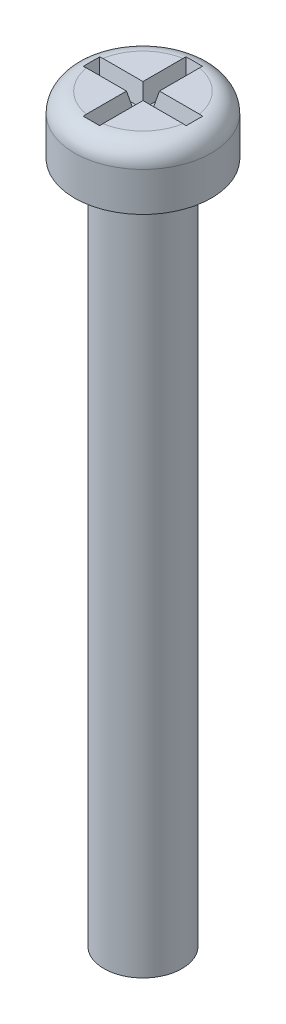
ISO-10303-21;
HEADER;
FILE_DESCRIPTION(('STEP AP214'),'2;1');
FILE_NAME('part.step','',(''),(''),'','','');
FILE_SCHEMA(('AUTOMOTIVE_DESIGN { 1 0 10303 214 1 1 1 1 }'));
ENDSEC;
DATA;
#1=APPLICATION_CONTEXT('core data for automotive mechanical design processes');
#2=APPLICATION_PROTOCOL_DEFINITION('international standard','automotive_design',2000,#1);
#3=PRODUCT_CONTEXT('',#1,'mechanical');
#4=PRODUCT('Part','Part','',(#3));
#5=PRODUCT_RELATED_PRODUCT_CATEGORY('part','',(#4));
#6=PRODUCT_DEFINITION_FORMATION('','',#4);
#7=PRODUCT_DEFINITION_CONTEXT('part definition',#1,'design');
#8=PRODUCT_DEFINITION('design','',#6,#7);
#9=PRODUCT_DEFINITION_SHAPE('','',#8);
#10=(LENGTH_UNIT() NAMED_UNIT(*) SI_UNIT(.MILLI.,.METRE.));
#11=(NAMED_UNIT(*) PLANE_ANGLE_UNIT() SI_UNIT($,.RADIAN.));
#12=(NAMED_UNIT(*) SI_UNIT($,.STERADIAN.) SOLID_ANGLE_UNIT());
#13=UNCERTAINTY_MEASURE_WITH_UNIT(LENGTH_MEASURE(1.E-05),#10,'distance_accuracy_value','');
#14=(GEOMETRIC_REPRESENTATION_CONTEXT(3) GLOBAL_UNCERTAINTY_ASSIGNED_CONTEXT((#13)) GLOBAL_UNIT_ASSIGNED_CONTEXT((#10,
#11,#12)) REPRESENTATION_CONTEXT('',''));
#15=CARTESIAN_POINT('',(0.,0.,0.));
#16=DIRECTION('',(0.,0.,1.));
#17=DIRECTION('',(1.,0.,0.));
#18=AXIS2_PLACEMENT_3D('',#15,#16,#17);
#19=CARTESIAN_POINT('',(0.,38.,0.));
#20=DIRECTION('',(0.,1.,0.));
#21=DIRECTION('',(0.,0.,1.));
#22=AXIS2_PLACEMENT_3D('',#19,#20,#21);
#23=PLANE('',#22);
#24=DIRECTION('',(-1.,0.,0.));
#25=VECTOR('',#24,1.);
#26=CARTESIAN_POINT('',(0.422769915905619,38.,-0.422769915905619));
#27=LINE('',#26,#25);
#28=CARTESIAN_POINT('',(2.47921168886506,38.,-0.422769915905619));
#29=VERTEX_POINT('',#28);
#30=CARTESIAN_POINT('',(0.422769915905619,38.,-0.422769915905619));
#31=VERTEX_POINT('',#30);
#32=EDGE_CURVE('E377',#29,#31,#27,.T.);
#33=ORIENTED_EDGE('',*,*,#32,.F.);
#34=CARTESIAN_POINT('',(0.,38.,0.));
#35=DIRECTION('',(0.,1.,0.));
#36=DIRECTION('',(0.,0.,1.));
#37=AXIS2_PLACEMENT_3D('',#34,#35,#36);
#38=CIRCLE('',#37,2.515);
#39=CARTESIAN_POINT('',(0.422769915905619,38.,-2.47921168886506));
#40=VERTEX_POINT('',#39);
#41=EDGE_CURVE('E263',#29,#40,#38,.T.);
#42=ORIENTED_EDGE('',*,*,#41,.T.);
#43=DIRECTION('',(0.,0.,-1.));
#44=VECTOR('',#43,1.);
#45=CARTESIAN_POINT('',(0.422769915905619,38.,-2.64154947271322));
#46=LINE('',#45,#44);
#47=EDGE_CURVE('E162',#31,#40,#46,.T.);
#48=ORIENTED_EDGE('',*,*,#47,.F.);
#49=EDGE_LOOP('',(#33,#42,#48));
#50=FACE_BOUND('',#49,.T.);
#51=ADVANCED_FACE('F35',(#50),#23,.T.);
#52=DIRECTION('',(0.,0.,1.));
#53=VECTOR('',#52,1.);
#54=CARTESIAN_POINT('',(-0.422769915905619,38.,-0.422769915905619));
#55=LINE('',#54,#53);
#56=CARTESIAN_POINT('',(-0.422769915905619,38.,-2.47921168886506));
#57=VERTEX_POINT('',#56);
#58=CARTESIAN_POINT('',(-0.422769915905619,38.,-0.422769915905619));
#59=VERTEX_POINT('',#58);
#60=EDGE_CURVE('E149',#57,#59,#55,.T.);
#61=ORIENTED_EDGE('',*,*,#60,.F.);
#62=CARTESIAN_POINT('',(0.,38.,0.));
#63=DIRECTION('',(0.,1.,0.));
#64=DIRECTION('',(0.,0.,1.));
#65=AXIS2_PLACEMENT_3D('',#62,#63,#64);
#66=CIRCLE('',#65,2.515);
#67=CARTESIAN_POINT('',(-2.47921168886506,38.,-0.422769915905619));
#68=VERTEX_POINT('',#67);
#69=EDGE_CURVE('E175',#57,#68,#66,.T.);
#70=ORIENTED_EDGE('',*,*,#69,.T.);
#71=DIRECTION('',(-1.,0.,0.));
#72=VECTOR('',#71,1.);
#73=CARTESIAN_POINT('',(-2.64154947271322,38.,-0.422769915905619));
#74=LINE('',#73,#72);
#75=EDGE_CURVE('E161',#59,#68,#74,.T.);
#76=ORIENTED_EDGE('',*,*,#75,.F.);
#77=EDGE_LOOP('',(#61,#70,#76));
#78=FACE_BOUND('',#77,.T.);
#79=ADVANCED_FACE('F174',(#78),#23,.T.);
#80=DIRECTION('',(1.,0.,0.));
#81=VECTOR('',#80,1.);
#82=CARTESIAN_POINT('',(-0.422769915905619,38.,0.422769915905619));
#83=LINE('',#82,#81);
#84=CARTESIAN_POINT('',(-2.47921168886506,38.,0.422769915905619));
#85=VERTEX_POINT('',#84);
#86=CARTESIAN_POINT('',(-0.422769915905619,38.,0.422769915905619));
#87=VERTEX_POINT('',#86);
#88=EDGE_CURVE('E176',#85,#87,#83,.T.);
#89=ORIENTED_EDGE('',*,*,#88,.F.);
#90=CARTESIAN_POINT('',(0.,38.,0.));
#91=DIRECTION('',(0.,1.,0.));
#92=DIRECTION('',(0.,0.,1.));
#93=AXIS2_PLACEMENT_3D('',#90,#91,#92);
#94=CIRCLE('',#93,2.515);
#95=CARTESIAN_POINT('',(-0.422769915905619,38.,2.47921168886506));
#96=VERTEX_POINT('',#95);
#97=EDGE_CURVE('E260',#85,#96,#94,.T.);
#98=ORIENTED_EDGE('',*,*,#97,.T.);
#99=DIRECTION('',(0.,0.,1.));
#100=VECTOR('',#99,1.);
#101=CARTESIAN_POINT('',(-0.422769915905619,38.,2.64154947271322));
#102=LINE('',#101,#100);
#103=EDGE_CURVE('E178',#87,#96,#102,.T.);
#104=ORIENTED_EDGE('',*,*,#103,.F.);
#105=EDGE_LOOP('',(#89,#98,#104));
#106=FACE_BOUND('',#105,.T.);
#107=ADVANCED_FACE('F407',(#106),#23,.T.);
#108=CARTESIAN_POINT('',(0.,35.,0.));
#109=DIRECTION('',(0.,-1.,0.));
#110=DIRECTION('',(0.,0.,-1.));
#111=AXIS2_PLACEMENT_3D('',#108,#109,#110);
#112=CYLINDRICAL_SURFACE('',#111,2.);
#113=CARTESIAN_POINT('',(0.,35.,0.));
#114=DIRECTION('',(0.,1.,0.));
#115=DIRECTION('',(0.,0.,1.));
#116=AXIS2_PLACEMENT_3D('',#113,#114,#115);
#117=CIRCLE('',#116,2.);
#118=CARTESIAN_POINT('',(0.,35.,2.));
#119=VERTEX_POINT('',#118);
#120=EDGE_CURVE('E253',#119,#119,#117,.T.);
#121=ORIENTED_EDGE('',*,*,#120,.F.);
#122=EDGE_LOOP('',(#121));
#123=FACE_BOUND('',#122,.T.);
#124=CARTESIAN_POINT('',(0.,0.,0.));
#125=DIRECTION('',(0.,1.,0.));
#126=DIRECTION('',(0.,0.,1.));
#127=AXIS2_PLACEMENT_3D('',#124,#125,#126);
#128=CIRCLE('',#127,2.);
#129=CARTESIAN_POINT('',(0.,0.,2.));
#130=VERTEX_POINT('',#129);
#131=EDGE_CURVE('E252',#130,#130,#128,.T.);
#132=ORIENTED_EDGE('',*,*,#131,.T.);
#133=EDGE_LOOP('',(#132));
#134=FACE_BOUND('',#133,.T.);
#135=ADVANCED_FACE('F412',(#123,#134),#112,.T.);
#136=CARTESIAN_POINT('',(0.,0.,0.));
#137=DIRECTION('',(0.,1.,0.));
#138=DIRECTION('',(0.,0.,1.));
#139=AXIS2_PLACEMENT_3D('',#136,#137,#138);
#140=PLANE('',#139);
#141=ORIENTED_EDGE('',*,*,#131,.F.);
#142=EDGE_LOOP('',(#141));
#143=FACE_BOUND('',#142,.T.);
#144=ADVANCED_FACE('F417',(#143),#140,.F.);
#145=CARTESIAN_POINT('',(0.,38.,0.));
#146=DIRECTION('',(0.,-1.,0.));
#147=DIRECTION('',(0.,0.,-1.));
#148=AXIS2_PLACEMENT_3D('',#145,#146,#147);
#149=CYLINDRICAL_SURFACE('',#148,3.515);
#150=CARTESIAN_POINT('',(0.,37.,0.));
#151=DIRECTION('',(0.,1.,0.));
#152=DIRECTION('',(0.,0.,1.));
#153=AXIS2_PLACEMENT_3D('',#150,#151,#152);
#154=CIRCLE('',#153,3.515);
#155=CARTESIAN_POINT('',(0.,37.,3.515));
#156=VERTEX_POINT('',#155);
#157=EDGE_CURVE('E11',#156,#156,#154,.F.);
#158=ORIENTED_EDGE('',*,*,#157,.T.);
#159=EDGE_LOOP('',(#158));
#160=FACE_BOUND('',#159,.T.);
#161=CARTESIAN_POINT('',(0.,35.,0.));
#162=DIRECTION('',(0.,1.,0.));
#163=DIRECTION('',(0.,0.,1.));
#164=AXIS2_PLACEMENT_3D('',#161,#162,#163);
#165=CIRCLE('',#164,3.515);
#166=CARTESIAN_POINT('',(0.,35.,3.515));
#167=VERTEX_POINT('',#166);
#168=EDGE_CURVE('E191',#167,#167,#165,.T.);
#169=ORIENTED_EDGE('',*,*,#168,.T.);
#170=EDGE_LOOP('',(#169));
#171=FACE_BOUND('',#170,.T.);
#172=ADVANCED_FACE('F421',(#160,#171),#149,.T.);
#173=DIRECTION('',(0.,0.,-1.));
#174=VECTOR('',#173,1.);
#175=CARTESIAN_POINT('',(0.422769915905619,38.,0.422769915905619));
#176=LINE('',#175,#174);
#177=CARTESIAN_POINT('',(0.422769915905619,38.,2.47921168886506));
#178=VERTEX_POINT('',#177);
#179=CARTESIAN_POINT('',(0.422769915905619,38.,0.422769915905619));
#180=VERTEX_POINT('',#179);
#181=EDGE_CURVE('E184',#178,#180,#176,.T.);
#182=ORIENTED_EDGE('',*,*,#181,.F.);
#183=CARTESIAN_POINT('',(0.,38.,0.));
#184=DIRECTION('',(0.,1.,0.));
#185=DIRECTION('',(0.,0.,1.));
#186=AXIS2_PLACEMENT_3D('',#183,#184,#185);
#187=CIRCLE('',#186,2.515);
#188=CARTESIAN_POINT('',(2.47921168886506,38.,0.422769915905619));
#189=VERTEX_POINT('',#188);
#190=EDGE_CURVE('E256',#178,#189,#187,.T.);
#191=ORIENTED_EDGE('',*,*,#190,.T.);
#192=DIRECTION('',(1.,0.,0.));
#193=VECTOR('',#192,1.);
#194=CARTESIAN_POINT('',(2.64154947271322,38.,0.422769915905619));
#195=LINE('',#194,#193);
#196=EDGE_CURVE('E186',#180,#189,#195,.T.);
#197=ORIENTED_EDGE('',*,*,#196,.F.);
#198=EDGE_LOOP('',(#182,#191,#197));
#199=FACE_BOUND('',#198,.T.);
#200=ADVANCED_FACE('F366',(#199),#23,.T.);
#201=CARTESIAN_POINT('',(0.,35.,0.));
#202=DIRECTION('',(0.,1.,0.));
#203=DIRECTION('',(0.,0.,1.));
#204=AXIS2_PLACEMENT_3D('',#201,#202,#203);
#205=PLANE('',#204);
#206=ORIENTED_EDGE('',*,*,#120,.T.);
#207=EDGE_LOOP('',(#206));
#208=FACE_BOUND('',#207,.T.);
#209=ORIENTED_EDGE('',*,*,#168,.F.);
#210=EDGE_LOOP('',(#209));
#211=FACE_BOUND('',#210,.T.);
#212=ADVANCED_FACE('F420',(#208,#211),#205,.F.);
#213=CARTESIAN_POINT('',(0.422769915905619,38.,-0.422769915905619));
#214=DIRECTION('',(0.,-0.207911690817759,-0.978147600733806));
#215=DIRECTION('',(0.,0.978147600733806,-0.207911690817759));
#216=AXIS2_PLACEMENT_3D('',#213,#214,#215);
#217=PLANE('',#216);
#218=DIRECTION('',(0.203558594952779,0.957667894857973,-0.203558594952779));
#219=VECTOR('',#218,1.);
#220=CARTESIAN_POINT('',(2.60651359835308,37.8351691705734,-0.387734041545471));
#221=LINE('',#220,#219);
#222=CARTESIAN_POINT('',(2.4289929110432,37.,-0.210213354235596));
#223=VERTEX_POINT('',#222);
#224=CARTESIAN_POINT('',(2.63890864587035,37.9875758865211,-0.420129089062744));
#225=VERTEX_POINT('',#224);
#226=EDGE_CURVE('E189',#223,#225,#221,.T.);
#227=ORIENTED_EDGE('',*,*,#226,.T.);
#228=CARTESIAN_POINT('',(2.63890864587035,37.9875758865211,-0.420129089062744));
#229=CARTESIAN_POINT('',(2.61246025382318,37.9917103029364,-0.421007886400498));
#230=CARTESIAN_POINT('',(2.58592795776817,37.9948128539393,-0.421667353974071));
#231=CARTESIAN_POINT('',(2.53269563825816,37.9989542188483,-0.422547628259755));
#232=CARTESIAN_POINT('',(2.50599561531141,37.9999930390051,-0.422768436300485));
#233=CARTESIAN_POINT('',(2.47921168886509,38.0000000000002,-0.422769915905651));
#234=B_SPLINE_CURVE_WITH_KNOTS('',3,(#228,#229,#230,#231,#232,#233),.UNSPECIFIED.,.F.,.F.,(4,2,
4),(0.,0.0801636519091327,0.160327061016982),.UNSPECIFIED.);
#235=EDGE_CURVE('E44',#225,#29,#234,.T.);
#236=ORIENTED_EDGE('',*,*,#235,.T.);
#237=ORIENTED_EDGE('',*,*,#32,.T.);
#238=DIRECTION('',(0.203558594952779,0.957667894857973,-0.203558594952779));
#239=VECTOR('',#238,1.);
#240=CARTESIAN_POINT('',(0.514707491003239,38.4325322839967,-0.514707491003239));
#241=LINE('',#240,#239);
#242=CARTESIAN_POINT('',(0.210213354235596,37.,-0.210213354235596));
#243=VERTEX_POINT('',#242);
#244=EDGE_CURVE('E193',#243,#31,#241,.T.);
#245=ORIENTED_EDGE('',*,*,#244,.F.);
#246=DIRECTION('',(-1.,0.,0.));
#247=VECTOR('',#246,1.);
#248=CARTESIAN_POINT('',(0.,37.,-0.210213354235596));
#249=LINE('',#248,#247);
#250=EDGE_CURVE('E188',#223,#243,#249,.T.);
#251=ORIENTED_EDGE('',*,*,#250,.F.);
#252=EDGE_LOOP('',(#227,#236,#237,#245,#251));
#253=FACE_BOUND('',#252,.T.);
#254=ADVANCED_FACE('F285',(#253),#217,.F.);
#255=CARTESIAN_POINT('',(2.64154947271322,38.,0.422769915905619));
#256=DIRECTION('',(0.978147600733806,-0.207911690817759,0.));
#257=DIRECTION('',(0.207911690817759,0.978147600733806,0.));
#258=AXIS2_PLACEMENT_3D('',#255,#256,#257);
#259=PLANE('',#258);
#260=DIRECTION('',(0.203558594952779,0.957667894857973,0.203558594952779));
#261=VECTOR('',#260,1.);
#262=CARTESIAN_POINT('',(2.64154947271322,38.,0.422769915905619));
#263=LINE('',#262,#261);
#264=CARTESIAN_POINT('',(2.4289929110432,37.,0.210213354235596));
#265=VERTEX_POINT('',#264);
#266=CARTESIAN_POINT('',(2.63890864587035,37.9875758865211,0.420129089062743));
#267=VERTEX_POINT('',#266);
#268=EDGE_CURVE('E192',#265,#267,#263,.T.);
#269=ORIENTED_EDGE('',*,*,#268,.T.);
#270=CARTESIAN_POINT('',(2.63890864587035,37.9875758865211,0.420129089062743));
#271=CARTESIAN_POINT('',(2.63926052612753,37.989231352974,0.350115794791615));
#272=CARTESIAN_POINT('',(2.63950472425311,37.9903802148282,0.280093037473652));
#273=CARTESIAN_POINT('',(2.63981715218977,37.9918500727061,0.140046852645141));
#274=CARTESIAN_POINT('',(2.6398854040906,37.9921711726538,0.0700234263225704));
#275=CARTESIAN_POINT('',(2.6398854040906,37.9921711726538,-0.070023426322571));
#276=CARTESIAN_POINT('',(2.63981715218977,37.9918500727061,-0.140046852645142));
#277=CARTESIAN_POINT('',(2.63950472425311,37.9903802148282,-0.280093037473653));
#278=CARTESIAN_POINT('',(2.63926052612753,37.989231352974,-0.350115794791616));
#279=CARTESIAN_POINT('',(2.63890864587035,37.9875758865211,-0.420129089062744));
#280=B_SPLINE_CURVE_WITH_KNOTS('',3,(#270,#271,#272,#273,#274,#275,#276,#277,#278,#279),
.UNSPECIFIED.,.F.,.F.,(4,2,2,2,4),(0.,0.210094701314381,0.420163024312075,0.630231347309768,
0.840326048624149),.UNSPECIFIED.);
#281=EDGE_CURVE('E51',#267,#225,#280,.T.);
#282=ORIENTED_EDGE('',*,*,#281,.T.);
#283=ORIENTED_EDGE('',*,*,#226,.F.);
#284=DIRECTION('',(0.,0.,-1.));
#285=VECTOR('',#284,1.);
#286=CARTESIAN_POINT('',(2.4289929110432,37.,0.));
#287=LINE('',#286,#285);
#288=EDGE_CURVE('E197',#265,#223,#287,.T.);
#289=ORIENTED_EDGE('',*,*,#288,.F.);
#290=EDGE_LOOP('',(#269,#282,#283,#289));
#291=FACE_BOUND('',#290,.T.);
#292=ADVANCED_FACE('F362',(#291),#259,.F.);
#293=CARTESIAN_POINT('',(2.64154947271322,38.,0.422769915905619));
#294=DIRECTION('',(0.,-0.207911690817759,0.978147600733806));
#295=DIRECTION('',(0.,-0.978147600733806,-0.207911690817759));
#296=AXIS2_PLACEMENT_3D('',#293,#294,#295);
#297=PLANE('',#296);
#298=ORIENTED_EDGE('',*,*,#196,.T.);
#299=CARTESIAN_POINT('',(2.47921168886506,38.,0.422769915905619));
#300=CARTESIAN_POINT('',(2.5059956153114,37.9999930390051,0.422768436300468));
#301=CARTESIAN_POINT('',(2.53269563825815,37.9989542188483,0.422547628259749));
#302=CARTESIAN_POINT('',(2.58592795776817,37.9948128539393,0.421667353974077));
#303=CARTESIAN_POINT('',(2.61246025382318,37.9917103029365,0.421007886400505));
#304=CARTESIAN_POINT('',(2.63890864587035,37.9875758865211,0.420129089062746));
#305=B_SPLINE_CURVE_WITH_KNOTS('',3,(#299,#300,#301,#302,#303,#304),.UNSPECIFIED.,.F.,.F.,(4,2,
4),(0.,0.0801634091078605,0.160327061016998),.UNSPECIFIED.);
#306=EDGE_CURVE('E59',#189,#267,#305,.T.);
#307=ORIENTED_EDGE('',*,*,#306,.T.);
#308=ORIENTED_EDGE('',*,*,#268,.F.);
#309=DIRECTION('',(1.,0.,0.));
#310=VECTOR('',#309,1.);
#311=CARTESIAN_POINT('',(0.,37.,0.210213354235596));
#312=LINE('',#311,#310);
#313=CARTESIAN_POINT('',(0.210213354235596,37.,0.210213354235596));
#314=VERTEX_POINT('',#313);
#315=EDGE_CURVE('E224',#314,#265,#312,.T.);
#316=ORIENTED_EDGE('',*,*,#315,.F.);
#317=DIRECTION('',(0.203558594952779,0.957667894857973,0.203558594952779));
#318=VECTOR('',#317,1.);
#319=CARTESIAN_POINT('',(0.514707491003239,38.4325322839967,0.514707491003239));
#320=LINE('',#319,#318);
#321=EDGE_CURVE('E215',#314,#180,#320,.T.);
#322=ORIENTED_EDGE('',*,*,#321,.T.);
#323=EDGE_LOOP('',(#298,#307,#308,#316,#322));
#324=FACE_BOUND('',#323,.T.);
#325=ADVANCED_FACE('F357',(#324),#297,.F.);
#326=CARTESIAN_POINT('',(0.422769915905619,38.,0.422769915905619));
#327=DIRECTION('',(0.978147600733806,-0.207911690817759,0.));
#328=DIRECTION('',(0.207911690817759,0.978147600733806,0.));
#329=AXIS2_PLACEMENT_3D('',#326,#327,#328);
#330=PLANE('',#329);
#331=DIRECTION('',(0.203558594952779,0.957667894857973,0.203558594952779));
#332=VECTOR('',#331,1.);
#333=CARTESIAN_POINT('',(0.387734041545471,37.8351691705734,2.60651359835307));
#334=LINE('',#333,#332);
#335=CARTESIAN_POINT('',(0.210213354235596,37.,2.4289929110432));
#336=VERTEX_POINT('',#335);
#337=CARTESIAN_POINT('',(0.420129089062744,37.9875758865211,2.63890864587035));
#338=VERTEX_POINT('',#337);
#339=EDGE_CURVE('E212',#336,#338,#334,.T.);
#340=ORIENTED_EDGE('',*,*,#339,.T.);
#341=CARTESIAN_POINT('',(0.420129089062744,37.9875758865211,2.63890864587035));
#342=CARTESIAN_POINT('',(0.421007886400498,37.9917103029364,2.61246025382318));
#343=CARTESIAN_POINT('',(0.421667353974071,37.9948128539393,2.58592795776817));
#344=CARTESIAN_POINT('',(0.422547628259755,37.9989542188483,2.53269563825816));
#345=CARTESIAN_POINT('',(0.422768436300485,37.9999930390051,2.50599561531141));
#346=CARTESIAN_POINT('',(0.422769915905651,38.0000000000002,2.47921168886509));
#347=B_SPLINE_CURVE_WITH_KNOTS('',3,(#341,#342,#343,#344,#345,#346),.UNSPECIFIED.,.F.,.F.,(4,2,
4),(0.,0.0801636519091322,0.160327061016981),.UNSPECIFIED.);
#348=EDGE_CURVE('E344',#338,#178,#347,.T.);
#349=ORIENTED_EDGE('',*,*,#348,.T.);
#350=ORIENTED_EDGE('',*,*,#181,.T.);
#351=ORIENTED_EDGE('',*,*,#321,.F.);
#352=DIRECTION('',(0.,0.,-1.));
#353=VECTOR('',#352,1.);
#354=CARTESIAN_POINT('',(0.210213354235596,37.,0.));
#355=LINE('',#354,#353);
#356=EDGE_CURVE('E227',#336,#314,#355,.T.);
#357=ORIENTED_EDGE('',*,*,#356,.F.);
#358=EDGE_LOOP('',(#340,#349,#350,#351,#357));
#359=FACE_BOUND('',#358,.T.);
#360=ADVANCED_FACE('F354',(#359),#330,.F.);
#361=CARTESIAN_POINT('',(-0.422769915905619,38.,2.64154947271322));
#362=DIRECTION('',(0.,-0.207911690817759,0.978147600733806));
#363=DIRECTION('',(0.,-0.978147600733806,-0.207911690817759));
#364=AXIS2_PLACEMENT_3D('',#361,#362,#363);
#365=PLANE('',#364);
#366=DIRECTION('',(-0.203558594952779,0.957667894857973,0.203558594952779));
#367=VECTOR('',#366,1.);
#368=CARTESIAN_POINT('',(-0.422769915905619,38.,2.64154947271322));
#369=LINE('',#368,#367);
#370=CARTESIAN_POINT('',(-0.210213354235597,37.,2.4289929110432));
#371=VERTEX_POINT('',#370);
#372=CARTESIAN_POINT('',(-0.420129089062743,37.9875758865211,2.63890864587035));
#373=VERTEX_POINT('',#372);
#374=EDGE_CURVE('E209',#371,#373,#369,.T.);
#375=ORIENTED_EDGE('',*,*,#374,.T.);
#376=CARTESIAN_POINT('',(-0.420129089062743,37.9875758865211,2.63890864587035));
#377=CARTESIAN_POINT('',(-0.350115794791615,37.989231352974,2.63926052612753));
#378=CARTESIAN_POINT('',(-0.280093037473653,37.9903802148282,2.63950472425311));
#379=CARTESIAN_POINT('',(-0.140046852645141,37.9918500727061,2.63981715218977));
#380=CARTESIAN_POINT('',(-0.0700234263225706,37.9921711726538,2.6398854040906));
#381=CARTESIAN_POINT('',(0.0700234263225708,37.9921711726538,2.6398854040906));
#382=CARTESIAN_POINT('',(0.140046852645142,37.9918500727061,2.63981715218977));
#383=CARTESIAN_POINT('',(0.280093037473653,37.9903802148282,2.63950472425311));
#384=CARTESIAN_POINT('',(0.350115794791616,37.989231352974,2.63926052612753));
#385=CARTESIAN_POINT('',(0.420129089062744,37.9875758865211,2.63890864587035));
#386=B_SPLINE_CURVE_WITH_KNOTS('',3,(#376,#377,#378,#379,#380,#381,#382,#383,#384,#385),
.UNSPECIFIED.,.F.,.F.,(4,2,2,2,4),(0.,0.210094701314381,0.420163024312075,0.630231347309768,
0.84032604862415),.UNSPECIFIED.);
#387=EDGE_CURVE('E339',#373,#338,#386,.T.);
#388=ORIENTED_EDGE('',*,*,#387,.T.);
#389=ORIENTED_EDGE('',*,*,#339,.F.);
#390=DIRECTION('',(1.,0.,0.));
#391=VECTOR('',#390,1.);
#392=CARTESIAN_POINT('',(0.,37.,2.4289929110432));
#393=LINE('',#392,#391);
#394=EDGE_CURVE('E230',#371,#336,#393,.T.);
#395=ORIENTED_EDGE('',*,*,#394,.F.);
#396=EDGE_LOOP('',(#375,#388,#389,#395));
#397=FACE_BOUND('',#396,.T.);
#398=ADVANCED_FACE('F330',(#397),#365,.F.);
#399=CARTESIAN_POINT('',(-0.422769915905619,38.,2.64154947271322));
#400=DIRECTION('',(-0.978147600733806,-0.207911690817759,0.));
#401=DIRECTION('',(0.207911690817759,-0.978147600733806,0.));
#402=AXIS2_PLACEMENT_3D('',#399,#400,#401);
#403=PLANE('',#402);
#404=ORIENTED_EDGE('',*,*,#103,.T.);
#405=CARTESIAN_POINT('',(-0.422769915905619,38.,2.47921168886506));
#406=CARTESIAN_POINT('',(-0.422768436300468,37.9999930390051,2.5059956153114));
#407=CARTESIAN_POINT('',(-0.422547628259749,37.9989542188483,2.53269563825815));
#408=CARTESIAN_POINT('',(-0.421667353974077,37.9948128539393,2.58592795776817));
#409=CARTESIAN_POINT('',(-0.421007886400505,37.9917103029365,2.61246025382318));
#410=CARTESIAN_POINT('',(-0.420129089062746,37.9875758865211,2.63890864587035));
#411=B_SPLINE_CURVE_WITH_KNOTS('',3,(#405,#406,#407,#408,#409,#410),.UNSPECIFIED.,.F.,.F.,(4,2,
4),(0.,0.0801634091078605,0.160327061016998),.UNSPECIFIED.);
#412=EDGE_CURVE('E334',#96,#373,#411,.T.);
#413=ORIENTED_EDGE('',*,*,#412,.T.);
#414=ORIENTED_EDGE('',*,*,#374,.F.);
#415=DIRECTION('',(0.,0.,1.));
#416=VECTOR('',#415,1.);
#417=CARTESIAN_POINT('',(-0.210213354235596,37.,0.));
#418=LINE('',#417,#416);
#419=CARTESIAN_POINT('',(-0.210213354235596,37.,0.210213354235596));
#420=VERTEX_POINT('',#419);
#421=EDGE_CURVE('E233',#420,#371,#418,.T.);
#422=ORIENTED_EDGE('',*,*,#421,.F.);
#423=DIRECTION('',(-0.203558594952779,0.957667894857973,0.203558594952779));
#424=VECTOR('',#423,1.);
#425=CARTESIAN_POINT('',(-0.514707491003239,38.4325322839967,0.514707491003239));
#426=LINE('',#425,#424);
#427=EDGE_CURVE('E206',#420,#87,#426,.T.);
#428=ORIENTED_EDGE('',*,*,#427,.T.);
#429=EDGE_LOOP('',(#404,#413,#414,#422,#428));
#430=FACE_BOUND('',#429,.T.);
#431=ADVANCED_FACE('F325',(#430),#403,.F.);
#432=CARTESIAN_POINT('',(-0.422769915905619,38.,0.422769915905619));
#433=DIRECTION('',(0.,-0.207911690817759,0.978147600733806));
#434=DIRECTION('',(0.,-0.978147600733806,-0.207911690817759));
#435=AXIS2_PLACEMENT_3D('',#432,#433,#434);
#436=PLANE('',#435);
#437=DIRECTION('',(-0.203558594952779,0.957667894857973,0.203558594952779));
#438=VECTOR('',#437,1.);
#439=CARTESIAN_POINT('',(-2.64154947271322,38.,0.422769915905619));
#440=LINE('',#439,#438);
#441=CARTESIAN_POINT('',(-2.4289929110432,37.,0.210213354235596));
#442=VERTEX_POINT('',#441);
#443=CARTESIAN_POINT('',(-2.63890864587035,37.9875758865211,0.420129089062743));
#444=VERTEX_POINT('',#443);
#445=EDGE_CURVE('E203',#442,#444,#440,.T.);
#446=ORIENTED_EDGE('',*,*,#445,.T.);
#447=CARTESIAN_POINT('',(-2.63890864587035,37.9875758865211,0.420129089062743));
#448=CARTESIAN_POINT('',(-2.61246025382318,37.9917103029364,0.421007886400498));
#449=CARTESIAN_POINT('',(-2.58592795776817,37.9948128539393,0.421667353974071));
#450=CARTESIAN_POINT('',(-2.53269563825816,37.9989542188483,0.422547628259755));
#451=CARTESIAN_POINT('',(-2.50599561531141,37.9999930390051,0.422768436300485));
#452=CARTESIAN_POINT('',(-2.47921168886509,38.0000000000002,0.422769915905651));
#453=B_SPLINE_CURVE_WITH_KNOTS('',3,(#447,#448,#449,#450,#451,#452),.UNSPECIFIED.,.F.,.F.,(4,2,
4),(0.,0.0801636519091322,0.160327061016981),.UNSPECIFIED.);
#454=EDGE_CURVE('E311',#444,#85,#453,.T.);
#455=ORIENTED_EDGE('',*,*,#454,.T.);
#456=ORIENTED_EDGE('',*,*,#88,.T.);
#457=ORIENTED_EDGE('',*,*,#427,.F.);
#458=DIRECTION('',(1.,0.,0.));
#459=VECTOR('',#458,1.);
#460=CARTESIAN_POINT('',(0.,37.,0.210213354235596));
#461=LINE('',#460,#459);
#462=EDGE_CURVE('E236',#442,#420,#461,.T.);
#463=ORIENTED_EDGE('',*,*,#462,.F.);
#464=EDGE_LOOP('',(#446,#455,#456,#457,#463));
#465=FACE_BOUND('',#464,.T.);
#466=ADVANCED_FACE('F320',(#465),#436,.F.);
#467=CARTESIAN_POINT('',(-2.64154947271322,38.,0.422769915905619));
#468=DIRECTION('',(-0.978147600733806,-0.207911690817759,0.));
#469=DIRECTION('',(0.207911690817759,-0.978147600733806,0.));
#470=AXIS2_PLACEMENT_3D('',#467,#468,#469);
#471=PLANE('',#470);
#472=DIRECTION('',(-0.203558594952779,0.957667894857973,-0.203558594952779));
#473=VECTOR('',#472,1.);
#474=CARTESIAN_POINT('',(-2.64154947271322,38.,-0.422769915905619));
#475=LINE('',#474,#473);
#476=CARTESIAN_POINT('',(-2.4289929110432,37.,-0.210213354235596));
#477=VERTEX_POINT('',#476);
#478=CARTESIAN_POINT('',(-2.63890864587035,37.9875758865211,-0.420129089062743));
#479=VERTEX_POINT('',#478);
#480=EDGE_CURVE('E171',#477,#479,#475,.T.);
#481=ORIENTED_EDGE('',*,*,#480,.T.);
#482=CARTESIAN_POINT('',(-2.63890864587035,37.9875758865211,-0.420129089062743));
#483=CARTESIAN_POINT('',(-2.63926052612753,37.989231352974,-0.350115794791616));
#484=CARTESIAN_POINT('',(-2.63950472425311,37.9903802148282,-0.280093037473653));
#485=CARTESIAN_POINT('',(-2.63981715218977,37.9918500727061,-0.140046852645141));
#486=CARTESIAN_POINT('',(-2.6398854040906,37.9921711726538,-0.0700234263225706));
#487=CARTESIAN_POINT('',(-2.6398854040906,37.9921711726538,0.0700234263225706));
#488=CARTESIAN_POINT('',(-2.63981715218977,37.9918500727061,0.140046852645141));
#489=CARTESIAN_POINT('',(-2.63950472425311,37.9903802148282,0.280093037473653));
#490=CARTESIAN_POINT('',(-2.63926052612753,37.989231352974,0.350115794791615));
#491=CARTESIAN_POINT('',(-2.63890864587035,37.9875758865211,0.420129089062743));
#492=B_SPLINE_CURVE_WITH_KNOTS('',3,(#482,#483,#484,#485,#486,#487,#488,#489,#490,#491),
.UNSPECIFIED.,.F.,.F.,(4,2,2,2,4),(0.,0.210094701314381,0.420163024312074,0.630231347309768,
0.840326048624149),.UNSPECIFIED.);
#493=EDGE_CURVE('E306',#479,#444,#492,.T.);
#494=ORIENTED_EDGE('',*,*,#493,.T.);
#495=ORIENTED_EDGE('',*,*,#445,.F.);
#496=DIRECTION('',(0.,0.,1.));
#497=VECTOR('',#496,1.);
#498=CARTESIAN_POINT('',(-2.4289929110432,37.,0.));
#499=LINE('',#498,#497);
#500=EDGE_CURVE('E239',#477,#442,#499,.T.);
#501=ORIENTED_EDGE('',*,*,#500,.F.);
#502=EDGE_LOOP('',(#481,#494,#495,#501));
#503=FACE_BOUND('',#502,.T.);
#504=ADVANCED_FACE('F317',(#503),#471,.F.);
#505=CARTESIAN_POINT('',(-2.64154947271322,38.,-0.422769915905619));
#506=DIRECTION('',(0.,-0.207911690817759,-0.978147600733806));
#507=DIRECTION('',(0.,0.978147600733806,-0.207911690817759));
#508=AXIS2_PLACEMENT_3D('',#505,#506,#507);
#509=PLANE('',#508);
#510=ORIENTED_EDGE('',*,*,#75,.T.);
#511=CARTESIAN_POINT('',(-2.47921168886506,38.,-0.422769915905619));
#512=CARTESIAN_POINT('',(-2.5059956153114,37.9999930390051,-0.422768436300468));
#513=CARTESIAN_POINT('',(-2.53269563825815,37.9989542188483,-0.422547628259749));
#514=CARTESIAN_POINT('',(-2.58592795776817,37.9948128539393,-0.421667353974077));
#515=CARTESIAN_POINT('',(-2.61246025382318,37.9917103029365,-0.421007886400505));
#516=CARTESIAN_POINT('',(-2.63890864587035,37.9875758865211,-0.420129089062746));
#517=B_SPLINE_CURVE_WITH_KNOTS('',3,(#511,#512,#513,#514,#515,#516),.UNSPECIFIED.,.F.,.F.,(4,2,
4),(0.,0.0801634091078605,0.160327061016998),.UNSPECIFIED.);
#518=EDGE_CURVE('E301',#68,#479,#517,.T.);
#519=ORIENTED_EDGE('',*,*,#518,.T.);
#520=ORIENTED_EDGE('',*,*,#480,.F.);
#521=DIRECTION('',(-1.,0.,0.));
#522=VECTOR('',#521,1.);
#523=CARTESIAN_POINT('',(0.,37.,-0.210213354235596));
#524=LINE('',#523,#522);
#525=CARTESIAN_POINT('',(-0.210213354235596,37.,-0.210213354235596));
#526=VERTEX_POINT('',#525);
#527=EDGE_CURVE('E169',#526,#477,#524,.T.);
#528=ORIENTED_EDGE('',*,*,#527,.F.);
#529=DIRECTION('',(-0.203558594952779,0.957667894857973,-0.203558594952779));
#530=VECTOR('',#529,1.);
#531=CARTESIAN_POINT('',(-0.514707491003239,38.4325322839967,-0.514707491003239));
#532=LINE('',#531,#530);
#533=EDGE_CURVE('E154',#526,#59,#532,.T.);
#534=ORIENTED_EDGE('',*,*,#533,.T.);
#535=EDGE_LOOP('',(#510,#519,#520,#528,#534));
#536=FACE_BOUND('',#535,.T.);
#537=ADVANCED_FACE('F166',(#536),#509,.F.);
#538=CARTESIAN_POINT('',(-0.422769915905619,38.,-0.422769915905619));
#539=DIRECTION('',(-0.978147600733806,-0.207911690817759,0.));
#540=DIRECTION('',(0.207911690817759,-0.978147600733806,0.));
#541=AXIS2_PLACEMENT_3D('',#538,#539,#540);
#542=PLANE('',#541);
#543=DIRECTION('',(-0.203558594952779,0.957667894857973,-0.203558594952779));
#544=VECTOR('',#543,1.);
#545=CARTESIAN_POINT('',(-0.422769915905619,38.,-2.64154947271322));
#546=LINE('',#545,#544);
#547=CARTESIAN_POINT('',(-0.210213354235597,37.,-2.4289929110432));
#548=VERTEX_POINT('',#547);
#549=CARTESIAN_POINT('',(-0.420129089062743,37.9875758865211,-2.63890864587035));
#550=VERTEX_POINT('',#549);
#551=EDGE_CURVE('E172',#548,#550,#546,.T.);
#552=ORIENTED_EDGE('',*,*,#551,.T.);
#553=CARTESIAN_POINT('',(-0.420129089062743,37.9875758865211,-2.63890864587035));
#554=CARTESIAN_POINT('',(-0.421007886400498,37.9917103029364,-2.61246025382318));
#555=CARTESIAN_POINT('',(-0.421667353974071,37.9948128539393,-2.58592795776817));
#556=CARTESIAN_POINT('',(-0.422547628259755,37.9989542188483,-2.53269563825816));
#557=CARTESIAN_POINT('',(-0.422768436300485,37.9999930390051,-2.50599561531141));
#558=CARTESIAN_POINT('',(-0.422769915905652,38.0000000000002,-2.47921168886509));
#559=B_SPLINE_CURVE_WITH_KNOTS('',3,(#553,#554,#555,#556,#557,#558),.UNSPECIFIED.,.F.,.F.,(4,2,
4),(0.,0.0801636519091331,0.160327061016982),.UNSPECIFIED.);
#560=EDGE_CURVE('E157',#550,#57,#559,.T.);
#561=ORIENTED_EDGE('',*,*,#560,.T.);
#562=ORIENTED_EDGE('',*,*,#60,.T.);
#563=ORIENTED_EDGE('',*,*,#533,.F.);
#564=DIRECTION('',(0.,0.,1.));
#565=VECTOR('',#564,1.);
#566=CARTESIAN_POINT('',(-0.210213354235596,37.,0.));
#567=LINE('',#566,#565);
#568=EDGE_CURVE('E243',#548,#526,#567,.T.);
#569=ORIENTED_EDGE('',*,*,#568,.F.);
#570=EDGE_LOOP('',(#552,#561,#562,#563,#569));
#571=FACE_BOUND('',#570,.T.);
#572=ADVANCED_FACE('F152',(#571),#542,.F.);
#573=CARTESIAN_POINT('',(-0.422769915905619,38.,-2.64154947271322));
#574=DIRECTION('',(0.,-0.207911690817759,-0.978147600733806));
#575=DIRECTION('',(0.,0.978147600733806,-0.207911690817759));
#576=AXIS2_PLACEMENT_3D('',#573,#574,#575);
#577=PLANE('',#576);
#578=DIRECTION('',(0.203558594952779,0.957667894857973,-0.203558594952779));
#579=VECTOR('',#578,1.);
#580=CARTESIAN_POINT('',(0.422769915905619,38.,-2.64154947271322));
#581=LINE('',#580,#579);
#582=CARTESIAN_POINT('',(0.210213354235596,37.,-2.4289929110432));
#583=VERTEX_POINT('',#582);
#584=CARTESIAN_POINT('',(0.420129089062743,37.9875758865211,-2.63890864587035));
#585=VERTEX_POINT('',#584);
#586=EDGE_CURVE('E196',#583,#585,#581,.T.);
#587=ORIENTED_EDGE('',*,*,#586,.T.);
#588=CARTESIAN_POINT('',(0.420129089062743,37.9875758865211,-2.63890864587035));
#589=CARTESIAN_POINT('',(0.350115794791615,37.989231352974,-2.63926052612753));
#590=CARTESIAN_POINT('',(0.280093037473652,37.9903802148282,-2.63950472425311));
#591=CARTESIAN_POINT('',(0.140046852645141,37.9918500727061,-2.63981715218977));
#592=CARTESIAN_POINT('',(0.0700234263225705,37.9921711726538,-2.6398854040906));
#593=CARTESIAN_POINT('',(-0.0700234263225708,37.9921711726538,-2.6398854040906));
#594=CARTESIAN_POINT('',(-0.140046852645142,37.9918500727061,-2.63981715218977));
#595=CARTESIAN_POINT('',(-0.280093037473653,37.9903802148282,-2.63950472425311));
#596=CARTESIAN_POINT('',(-0.350115794791615,37.989231352974,-2.63926052612753));
#597=CARTESIAN_POINT('',(-0.420129089062743,37.9875758865211,-2.63890864587035));
#598=B_SPLINE_CURVE_WITH_KNOTS('',3,(#588,#589,#590,#591,#592,#593,#594,#595,#596,#597),
.UNSPECIFIED.,.F.,.F.,(4,2,2,2,4),(0.,0.210094701314381,0.420163024312074,0.630231347309768,
0.840326048624149),.UNSPECIFIED.);
#599=EDGE_CURVE('E272',#585,#550,#598,.T.);
#600=ORIENTED_EDGE('',*,*,#599,.T.);
#601=ORIENTED_EDGE('',*,*,#551,.F.);
#602=DIRECTION('',(-1.,0.,0.));
#603=VECTOR('',#602,1.);
#604=CARTESIAN_POINT('',(0.,37.,-2.4289929110432));
#605=LINE('',#604,#603);
#606=EDGE_CURVE('E245',#583,#548,#605,.T.);
#607=ORIENTED_EDGE('',*,*,#606,.F.);
#608=EDGE_LOOP('',(#587,#600,#601,#607));
#609=FACE_BOUND('',#608,.T.);
#610=ADVANCED_FACE('F283',(#609),#577,.F.);
#611=CARTESIAN_POINT('',(0.422769915905619,38.,-2.64154947271322));
#612=DIRECTION('',(0.978147600733806,-0.207911690817759,0.));
#613=DIRECTION('',(0.207911690817759,0.978147600733806,0.));
#614=AXIS2_PLACEMENT_3D('',#611,#612,#613);
#615=PLANE('',#614);
#616=ORIENTED_EDGE('',*,*,#47,.T.);
#617=CARTESIAN_POINT('',(0.422769915905619,38.,-2.47921168886506));
#618=CARTESIAN_POINT('',(0.422768436300468,37.9999930390051,-2.5059956153114));
#619=CARTESIAN_POINT('',(0.422547628259749,37.9989542188483,-2.53269563825815));
#620=CARTESIAN_POINT('',(0.421667353974077,37.9948128539393,-2.58592795776817));
#621=CARTESIAN_POINT('',(0.421007886400505,37.9917103029365,-2.61246025382318));
#622=CARTESIAN_POINT('',(0.420129089062746,37.9875758865211,-2.63890864587035));
#623=B_SPLINE_CURVE_WITH_KNOTS('',3,(#617,#618,#619,#620,#621,#622),.UNSPECIFIED.,.F.,.F.,(4,2,
4),(0.,0.0801634091078614,0.160327061016999),.UNSPECIFIED.);
#624=EDGE_CURVE('E266',#40,#585,#623,.T.);
#625=ORIENTED_EDGE('',*,*,#624,.T.);
#626=ORIENTED_EDGE('',*,*,#586,.F.);
#627=DIRECTION('',(0.,0.,-1.));
#628=VECTOR('',#627,1.);
#629=CARTESIAN_POINT('',(0.210213354235596,37.,0.));
#630=LINE('',#629,#628);
#631=EDGE_CURVE('E221',#243,#583,#630,.T.);
#632=ORIENTED_EDGE('',*,*,#631,.F.);
#633=ORIENTED_EDGE('',*,*,#244,.T.);
#634=EDGE_LOOP('',(#616,#625,#626,#632,#633));
#635=FACE_BOUND('',#634,.T.);
#636=ADVANCED_FACE('F278',(#635),#615,.F.);
#637=CARTESIAN_POINT('',(0.,37.,0.));
#638=DIRECTION('',(0.,1.,0.));
#639=DIRECTION('',(0.,0.,1.));
#640=AXIS2_PLACEMENT_3D('',#637,#638,#639);
#641=PLANE('',#640);
#642=ORIENTED_EDGE('',*,*,#250,.T.);
#643=ORIENTED_EDGE('',*,*,#631,.T.);
#644=ORIENTED_EDGE('',*,*,#606,.T.);
#645=ORIENTED_EDGE('',*,*,#568,.T.);
#646=ORIENTED_EDGE('',*,*,#527,.T.);
#647=ORIENTED_EDGE('',*,*,#500,.T.);
#648=ORIENTED_EDGE('',*,*,#462,.T.);
#649=ORIENTED_EDGE('',*,*,#421,.T.);
#650=ORIENTED_EDGE('',*,*,#394,.T.);
#651=ORIENTED_EDGE('',*,*,#356,.T.);
#652=ORIENTED_EDGE('',*,*,#315,.T.);
#653=ORIENTED_EDGE('',*,*,#288,.T.);
#654=EDGE_LOOP('',(#642,#643,#644,#645,#646,#647,#648,#649,#650,#651,#652,#653));
#655=FACE_BOUND('',#654,.T.);
#656=ADVANCED_FACE('F282',(#655),#641,.T.);
#657=CARTESIAN_POINT('',(0.,37.,0.));
#658=DIRECTION('',(0.,1.,0.));
#659=DIRECTION('',(0.,0.,1.));
#660=AXIS2_PLACEMENT_3D('',#657,#658,#659);
#661=TOROIDAL_SURFACE('',#660,2.515,1.);
#662=ORIENTED_EDGE('',*,*,#157,.F.);
#663=EDGE_LOOP('',(#662));
#664=FACE_BOUND('',#663,.T.);
#665=ORIENTED_EDGE('',*,*,#624,.F.);
#666=ORIENTED_EDGE('',*,*,#41,.F.);
#667=ORIENTED_EDGE('',*,*,#235,.F.);
#668=ORIENTED_EDGE('',*,*,#281,.F.);
#669=ORIENTED_EDGE('',*,*,#306,.F.);
#670=ORIENTED_EDGE('',*,*,#190,.F.);
#671=ORIENTED_EDGE('',*,*,#348,.F.);
#672=ORIENTED_EDGE('',*,*,#387,.F.);
#673=ORIENTED_EDGE('',*,*,#412,.F.);
#674=ORIENTED_EDGE('',*,*,#97,.F.);
#675=ORIENTED_EDGE('',*,*,#454,.F.);
#676=ORIENTED_EDGE('',*,*,#493,.F.);
#677=ORIENTED_EDGE('',*,*,#518,.F.);
#678=ORIENTED_EDGE('',*,*,#69,.F.);
#679=ORIENTED_EDGE('',*,*,#560,.F.);
#680=ORIENTED_EDGE('',*,*,#599,.F.);
#681=EDGE_LOOP('',(#665,#666,#667,#668,#669,#670,#671,#672,#673,#674,#675,#676,#677,#678,#679,#680));
#682=FACE_BOUND('',#681,.T.);
#683=ADVANCED_FACE('F37',(#664,#682),#661,.T.);
#684=CLOSED_SHELL('',(#51,#79,#107,#135,#144,#172,#200,#212,#254,#292,#325,#360,#398,#431,#466,
#504,#537,#572,#610,#636,#656,#683));
#685=MANIFOLD_SOLID_BREP('B2',#684);
#686=ADVANCED_BREP_SHAPE_REPRESENTATION('',(#18,#685),#14);
#687=SHAPE_DEFINITION_REPRESENTATION(#9,#686);
ENDSEC;
END-ISO-10303-21;
